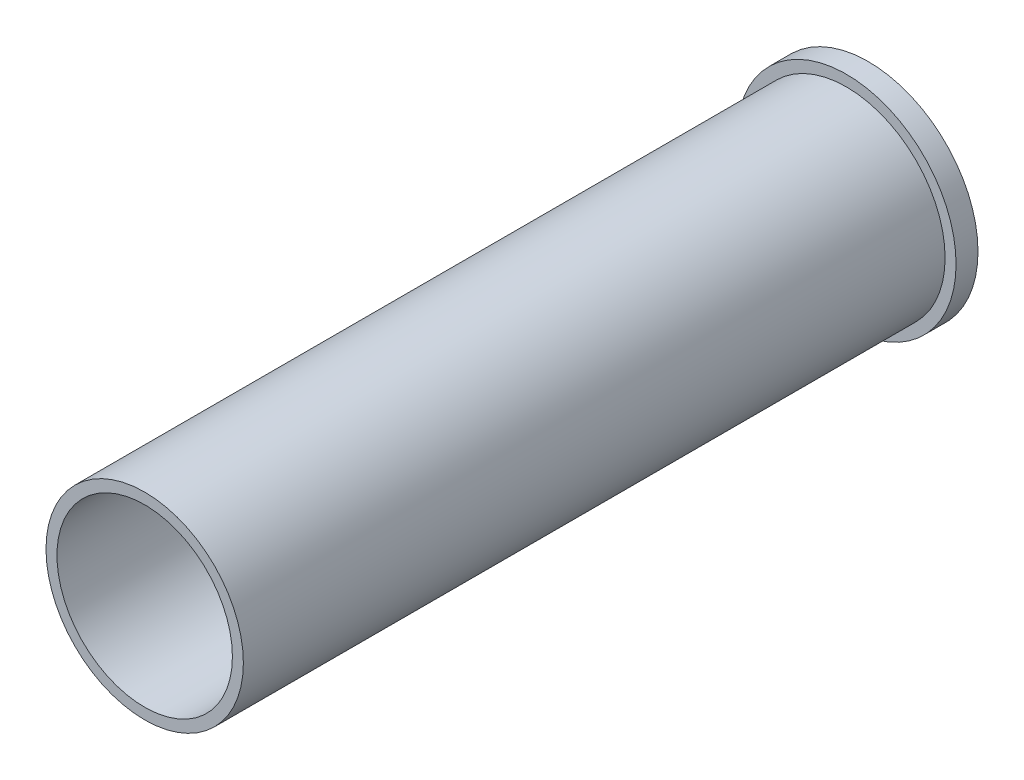
ISO-10303-21;
HEADER;
FILE_DESCRIPTION(('STEP AP214'),'2;1');
FILE_NAME('part.step','',(''),(''),'','','');
FILE_SCHEMA(('AUTOMOTIVE_DESIGN { 1 0 10303 214 1 1 1 1 }'));
ENDSEC;
DATA;
#1=APPLICATION_CONTEXT('core data for automotive mechanical design processes');
#2=APPLICATION_PROTOCOL_DEFINITION('international standard','automotive_design',2000,#1);
#3=PRODUCT_CONTEXT('',#1,'mechanical');
#4=PRODUCT('Part','Part','',(#3));
#5=PRODUCT_RELATED_PRODUCT_CATEGORY('part','',(#4));
#6=PRODUCT_DEFINITION_FORMATION('','',#4);
#7=PRODUCT_DEFINITION_CONTEXT('part definition',#1,'design');
#8=PRODUCT_DEFINITION('design','',#6,#7);
#9=PRODUCT_DEFINITION_SHAPE('','',#8);
#10=(LENGTH_UNIT() NAMED_UNIT(*) SI_UNIT(.MILLI.,.METRE.));
#11=(NAMED_UNIT(*) PLANE_ANGLE_UNIT() SI_UNIT($,.RADIAN.));
#12=(NAMED_UNIT(*) SI_UNIT($,.STERADIAN.) SOLID_ANGLE_UNIT());
#13=UNCERTAINTY_MEASURE_WITH_UNIT(LENGTH_MEASURE(1.E-05),#10,'distance_accuracy_value','');
#14=(GEOMETRIC_REPRESENTATION_CONTEXT(3) GLOBAL_UNCERTAINTY_ASSIGNED_CONTEXT((#13)) GLOBAL_UNIT_ASSIGNED_CONTEXT((#10,
#11,#12)) REPRESENTATION_CONTEXT('',''));
#15=CARTESIAN_POINT('',(0.,0.,0.));
#16=DIRECTION('',(0.,0.,1.));
#17=DIRECTION('',(1.,0.,0.));
#18=AXIS2_PLACEMENT_3D('',#15,#16,#17);
#19=CARTESIAN_POINT('',(0.,0.,-12.7));
#20=DIRECTION('',(0.,0.,1.));
#21=DIRECTION('',(1.,0.,0.));
#22=AXIS2_PLACEMENT_3D('',#19,#20,#21);
#23=CYLINDRICAL_SURFACE('',#22,63.5);
#24=CARTESIAN_POINT('',(0.,0.,-12.7));
#25=DIRECTION('',(0.,0.,1.));
#26=DIRECTION('',(1.,0.,0.));
#27=AXIS2_PLACEMENT_3D('',#24,#25,#26);
#28=CIRCLE('',#27,63.5);
#29=CARTESIAN_POINT('',(63.5,0.,-12.7));
#30=VERTEX_POINT('',#29);
#31=EDGE_CURVE('E42',#30,#30,#28,.T.);
#32=ORIENTED_EDGE('',*,*,#31,.T.);
#33=EDGE_LOOP('',(#32));
#34=FACE_BOUND('',#33,.T.);
#35=CARTESIAN_POINT('',(0.,0.,0.));
#36=DIRECTION('',(0.,0.,1.));
#37=DIRECTION('',(1.,0.,0.));
#38=AXIS2_PLACEMENT_3D('',#35,#36,#37);
#39=CIRCLE('',#38,63.5);
#40=CARTESIAN_POINT('',(63.5,0.,0.));
#41=VERTEX_POINT('',#40);
#42=EDGE_CURVE('E38',#41,#41,#39,.T.);
#43=ORIENTED_EDGE('',*,*,#42,.F.);
#44=EDGE_LOOP('',(#43));
#45=FACE_BOUND('',#44,.T.);
#46=ADVANCED_FACE('F35',(#34,#45),#23,.T.);
#47=CARTESIAN_POINT('',(0.,0.,-12.7));
#48=DIRECTION('',(0.,0.,1.));
#49=DIRECTION('',(1.,0.,0.));
#50=AXIS2_PLACEMENT_3D('',#47,#48,#49);
#51=CYLINDRICAL_SURFACE('',#50,50.8);
#52=CARTESIAN_POINT('',(0.,0.,-12.7));
#53=DIRECTION('',(0.,0.,1.));
#54=DIRECTION('',(1.,0.,0.));
#55=AXIS2_PLACEMENT_3D('',#52,#53,#54);
#56=CIRCLE('',#55,50.8);
#57=CARTESIAN_POINT('',(50.8,0.,-12.7));
#58=VERTEX_POINT('',#57);
#59=EDGE_CURVE('E10',#58,#58,#56,.T.);
#60=ORIENTED_EDGE('',*,*,#59,.F.);
#61=EDGE_LOOP('',(#60));
#62=FACE_BOUND('',#61,.T.);
#63=CARTESIAN_POINT('',(0.,0.,406.4));
#64=DIRECTION('',(0.,0.,1.));
#65=DIRECTION('',(1.,0.,0.));
#66=AXIS2_PLACEMENT_3D('',#63,#64,#65);
#67=CIRCLE('',#66,50.8);
#68=CARTESIAN_POINT('',(50.8,0.,406.4));
#69=VERTEX_POINT('',#68);
#70=EDGE_CURVE('E51',#69,#69,#67,.T.);
#71=ORIENTED_EDGE('',*,*,#70,.T.);
#72=EDGE_LOOP('',(#71));
#73=FACE_BOUND('',#72,.T.);
#74=ADVANCED_FACE('F58',(#62,#73),#51,.F.);
#75=CARTESIAN_POINT('',(0.,0.,-12.7));
#76=DIRECTION('',(0.,0.,1.));
#77=DIRECTION('',(1.,0.,0.));
#78=AXIS2_PLACEMENT_3D('',#75,#76,#77);
#79=PLANE('',#78);
#80=ORIENTED_EDGE('',*,*,#31,.F.);
#81=EDGE_LOOP('',(#80));
#82=FACE_BOUND('',#81,.T.);
#83=ORIENTED_EDGE('',*,*,#59,.T.);
#84=EDGE_LOOP('',(#83));
#85=FACE_BOUND('',#84,.T.);
#86=ADVANCED_FACE('F75',(#82,#85),#79,.F.);
#87=CARTESIAN_POINT('',(0.,0.,0.));
#88=DIRECTION('',(0.,0.,1.));
#89=DIRECTION('',(1.,0.,0.));
#90=AXIS2_PLACEMENT_3D('',#87,#88,#89);
#91=PLANE('',#90);
#92=CARTESIAN_POINT('',(0.,0.,0.));
#93=DIRECTION('',(0.,0.,1.));
#94=DIRECTION('',(1.,0.,0.));
#95=AXIS2_PLACEMENT_3D('',#92,#93,#94);
#96=CIRCLE('',#95,57.15);
#97=CARTESIAN_POINT('',(57.15,0.,0.));
#98=VERTEX_POINT('',#97);
#99=EDGE_CURVE('E48',#98,#98,#96,.T.);
#100=ORIENTED_EDGE('',*,*,#99,.F.);
#101=EDGE_LOOP('',(#100));
#102=FACE_BOUND('',#101,.T.);
#103=ORIENTED_EDGE('',*,*,#42,.T.);
#104=EDGE_LOOP('',(#103));
#105=FACE_BOUND('',#104,.T.);
#106=ADVANCED_FACE('F69',(#102,#105),#91,.T.);
#107=CARTESIAN_POINT('',(0.,0.,406.4));
#108=DIRECTION('',(0.,0.,-1.));
#109=DIRECTION('',(-1.,0.,0.));
#110=AXIS2_PLACEMENT_3D('',#107,#108,#109);
#111=CYLINDRICAL_SURFACE('',#110,57.15);
#112=CARTESIAN_POINT('',(0.,0.,406.4));
#113=DIRECTION('',(0.,0.,1.));
#114=DIRECTION('',(1.,0.,0.));
#115=AXIS2_PLACEMENT_3D('',#112,#113,#114);
#116=CIRCLE('',#115,57.15);
#117=CARTESIAN_POINT('',(57.15,0.,406.4));
#118=VERTEX_POINT('',#117);
#119=EDGE_CURVE('E52',#118,#118,#116,.T.);
#120=ORIENTED_EDGE('',*,*,#119,.F.);
#121=EDGE_LOOP('',(#120));
#122=FACE_BOUND('',#121,.T.);
#123=ORIENTED_EDGE('',*,*,#99,.T.);
#124=EDGE_LOOP('',(#123));
#125=FACE_BOUND('',#124,.T.);
#126=ADVANCED_FACE('F63',(#122,#125),#111,.T.);
#127=CARTESIAN_POINT('',(0.,0.,406.4));
#128=DIRECTION('',(0.,0.,1.));
#129=DIRECTION('',(1.,0.,0.));
#130=AXIS2_PLACEMENT_3D('',#127,#128,#129);
#131=PLANE('',#130);
#132=ORIENTED_EDGE('',*,*,#70,.F.);
#133=EDGE_LOOP('',(#132));
#134=FACE_BOUND('',#133,.T.);
#135=ORIENTED_EDGE('',*,*,#119,.T.);
#136=EDGE_LOOP('',(#135));
#137=FACE_BOUND('',#136,.T.);
#138=ADVANCED_FACE('F60',(#134,#137),#131,.T.);
#139=CLOSED_SHELL('',(#46,#74,#86,#106,#126,#138));
#140=MANIFOLD_SOLID_BREP('B2',#139);
#141=ADVANCED_BREP_SHAPE_REPRESENTATION('',(#18,#140),#14);
#142=SHAPE_DEFINITION_REPRESENTATION(#9,#141);
ENDSEC;
END-ISO-10303-21;
